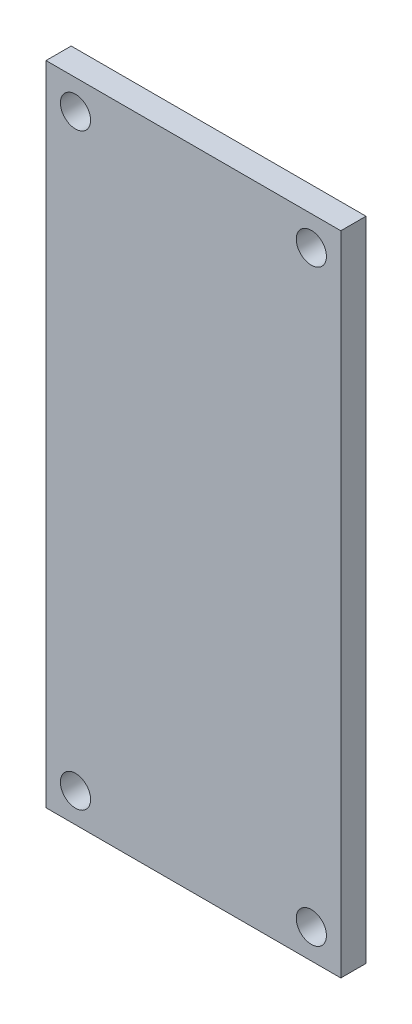
ISO-10303-21;
HEADER;
FILE_DESCRIPTION(('STEP AP214'),'2;1');
FILE_NAME('part.step','',(''),(''),'','','');
FILE_SCHEMA(('AUTOMOTIVE_DESIGN { 1 0 10303 214 1 1 1 1 }'));
ENDSEC;
DATA;
#1=APPLICATION_CONTEXT('core data for automotive mechanical design processes');
#2=APPLICATION_PROTOCOL_DEFINITION('international standard','automotive_design',2000,#1);
#3=PRODUCT_CONTEXT('',#1,'mechanical');
#4=PRODUCT('Part','Part','',(#3));
#5=PRODUCT_RELATED_PRODUCT_CATEGORY('part','',(#4));
#6=PRODUCT_DEFINITION_FORMATION('','',#4);
#7=PRODUCT_DEFINITION_CONTEXT('part definition',#1,'design');
#8=PRODUCT_DEFINITION('design','',#6,#7);
#9=PRODUCT_DEFINITION_SHAPE('','',#8);
#10=(LENGTH_UNIT() NAMED_UNIT(*) SI_UNIT(.MILLI.,.METRE.));
#11=(NAMED_UNIT(*) PLANE_ANGLE_UNIT() SI_UNIT($,.RADIAN.));
#12=(NAMED_UNIT(*) SI_UNIT($,.STERADIAN.) SOLID_ANGLE_UNIT());
#13=UNCERTAINTY_MEASURE_WITH_UNIT(LENGTH_MEASURE(1.E-05),#10,'distance_accuracy_value','');
#14=(GEOMETRIC_REPRESENTATION_CONTEXT(3) GLOBAL_UNCERTAINTY_ASSIGNED_CONTEXT((#13)) GLOBAL_UNIT_ASSIGNED_CONTEXT((#10,
#11,#12)) REPRESENTATION_CONTEXT('',''));
#15=CARTESIAN_POINT('',(0.,0.,0.));
#16=DIRECTION('',(0.,0.,1.));
#17=DIRECTION('',(1.,0.,0.));
#18=AXIS2_PLACEMENT_3D('',#15,#16,#17);
#19=CARTESIAN_POINT('',(-10.25,22.5,1.75));
#20=DIRECTION('',(1.,0.,0.));
#21=DIRECTION('',(0.,0.,-1.));
#22=AXIS2_PLACEMENT_3D('',#19,#20,#21);
#23=PLANE('',#22);
#24=DIRECTION('',(0.,-1.,0.));
#25=VECTOR('',#24,1.);
#26=CARTESIAN_POINT('',(-10.25,22.5,0.));
#27=LINE('',#26,#25);
#28=CARTESIAN_POINT('',(-10.25,22.5,0.));
#29=VERTEX_POINT('',#28);
#30=CARTESIAN_POINT('',(-10.25,-22.5,0.));
#31=VERTEX_POINT('',#30);
#32=EDGE_CURVE('E99',#29,#31,#27,.T.);
#33=ORIENTED_EDGE('',*,*,#32,.T.);
#34=DIRECTION('',(0.,0.,-1.));
#35=VECTOR('',#34,1.);
#36=CARTESIAN_POINT('',(-10.25,-22.5,1.75));
#37=LINE('',#36,#35);
#38=CARTESIAN_POINT('',(-10.25,-22.5,1.75));
#39=VERTEX_POINT('',#38);
#40=EDGE_CURVE('E11',#39,#31,#37,.T.);
#41=ORIENTED_EDGE('',*,*,#40,.F.);
#42=DIRECTION('',(0.,-1.,0.));
#43=VECTOR('',#42,1.);
#44=CARTESIAN_POINT('',(-10.25,22.5,1.75));
#45=LINE('',#44,#43);
#46=CARTESIAN_POINT('',(-10.25,22.5,1.75));
#47=VERTEX_POINT('',#46);
#48=EDGE_CURVE('E87',#47,#39,#45,.T.);
#49=ORIENTED_EDGE('',*,*,#48,.F.);
#50=DIRECTION('',(0.,0.,-1.));
#51=VECTOR('',#50,1.);
#52=CARTESIAN_POINT('',(-10.25,22.5,1.75));
#53=LINE('',#52,#51);
#54=EDGE_CURVE('E95',#47,#29,#53,.T.);
#55=ORIENTED_EDGE('',*,*,#54,.T.);
#56=EDGE_LOOP('',(#33,#41,#49,#55));
#57=FACE_BOUND('',#56,.T.);
#58=ADVANCED_FACE('F36',(#57),#23,.F.);
#59=CARTESIAN_POINT('',(-10.25,-22.5,1.75));
#60=DIRECTION('',(0.,1.,0.));
#61=DIRECTION('',(0.,0.,1.));
#62=AXIS2_PLACEMENT_3D('',#59,#60,#61);
#63=PLANE('',#62);
#64=DIRECTION('',(1.,0.,0.));
#65=VECTOR('',#64,1.);
#66=CARTESIAN_POINT('',(-10.25,-22.5,0.));
#67=LINE('',#66,#65);
#68=CARTESIAN_POINT('',(10.25,-22.5,0.));
#69=VERTEX_POINT('',#68);
#70=EDGE_CURVE('E91',#31,#69,#67,.T.);
#71=ORIENTED_EDGE('',*,*,#70,.T.);
#72=DIRECTION('',(0.,0.,-1.));
#73=VECTOR('',#72,1.);
#74=CARTESIAN_POINT('',(10.25,-22.5,1.75));
#75=LINE('',#74,#73);
#76=CARTESIAN_POINT('',(10.25,-22.5,1.75));
#77=VERTEX_POINT('',#76);
#78=EDGE_CURVE('E44',#77,#69,#75,.T.);
#79=ORIENTED_EDGE('',*,*,#78,.F.);
#80=DIRECTION('',(1.,0.,0.));
#81=VECTOR('',#80,1.);
#82=CARTESIAN_POINT('',(-10.25,-22.5,1.75));
#83=LINE('',#82,#81);
#84=EDGE_CURVE('E82',#39,#77,#83,.T.);
#85=ORIENTED_EDGE('',*,*,#84,.F.);
#86=ORIENTED_EDGE('',*,*,#40,.T.);
#87=EDGE_LOOP('',(#71,#79,#85,#86));
#88=FACE_BOUND('',#87,.T.);
#89=ADVANCED_FACE('F90',(#88),#63,.F.);
#90=CARTESIAN_POINT('',(10.25,22.5,1.75));
#91=DIRECTION('',(-1.,0.,0.));
#92=DIRECTION('',(0.,0.,1.));
#93=AXIS2_PLACEMENT_3D('',#90,#91,#92);
#94=PLANE('',#93);
#95=DIRECTION('',(0.,1.,0.));
#96=VECTOR('',#95,1.);
#97=CARTESIAN_POINT('',(10.25,22.5,0.));
#98=LINE('',#97,#96);
#99=CARTESIAN_POINT('',(10.25,22.5,0.));
#100=VERTEX_POINT('',#99);
#101=EDGE_CURVE('E69',#69,#100,#98,.T.);
#102=ORIENTED_EDGE('',*,*,#101,.T.);
#103=DIRECTION('',(0.,0.,-1.));
#104=VECTOR('',#103,1.);
#105=CARTESIAN_POINT('',(10.25,22.5,1.75));
#106=LINE('',#105,#104);
#107=CARTESIAN_POINT('',(10.25,22.5,1.75));
#108=VERTEX_POINT('',#107);
#109=EDGE_CURVE('E92',#108,#100,#106,.T.);
#110=ORIENTED_EDGE('',*,*,#109,.F.);
#111=DIRECTION('',(0.,1.,0.));
#112=VECTOR('',#111,1.);
#113=CARTESIAN_POINT('',(10.25,22.5,1.75));
#114=LINE('',#113,#112);
#115=EDGE_CURVE('E85',#77,#108,#114,.T.);
#116=ORIENTED_EDGE('',*,*,#115,.F.);
#117=ORIENTED_EDGE('',*,*,#78,.T.);
#118=EDGE_LOOP('',(#102,#110,#116,#117));
#119=FACE_BOUND('',#118,.T.);
#120=ADVANCED_FACE('F93',(#119),#94,.F.);
#121=CARTESIAN_POINT('',(-10.25,22.5,1.75));
#122=DIRECTION('',(0.,-1.,0.));
#123=DIRECTION('',(0.,0.,-1.));
#124=AXIS2_PLACEMENT_3D('',#121,#122,#123);
#125=PLANE('',#124);
#126=DIRECTION('',(-1.,0.,0.));
#127=VECTOR('',#126,1.);
#128=CARTESIAN_POINT('',(-10.25,22.5,0.));
#129=LINE('',#128,#127);
#130=EDGE_CURVE('E75',#100,#29,#129,.T.);
#131=ORIENTED_EDGE('',*,*,#130,.T.);
#132=ORIENTED_EDGE('',*,*,#54,.F.);
#133=DIRECTION('',(-1.,0.,0.));
#134=VECTOR('',#133,1.);
#135=CARTESIAN_POINT('',(-10.25,22.5,1.75));
#136=LINE('',#135,#134);
#137=EDGE_CURVE('E52',#108,#47,#136,.T.);
#138=ORIENTED_EDGE('',*,*,#137,.F.);
#139=ORIENTED_EDGE('',*,*,#109,.T.);
#140=EDGE_LOOP('',(#131,#132,#138,#139));
#141=FACE_BOUND('',#140,.T.);
#142=ADVANCED_FACE('F107',(#141),#125,.F.);
#143=CARTESIAN_POINT('',(-10.25,-22.5,1.75));
#144=DIRECTION('',(0.,0.,1.));
#145=DIRECTION('',(1.,0.,0.));
#146=AXIS2_PLACEMENT_3D('',#143,#144,#145);
#147=PLANE('',#146);
#148=CARTESIAN_POINT('',(8.2,20.45,1.75));
#149=DIRECTION('',(0.,0.,1.));
#150=DIRECTION('',(1.,0.,0.));
#151=AXIS2_PLACEMENT_3D('',#148,#149,#150);
#152=CIRCLE('',#151,1.05);
#153=CARTESIAN_POINT('',(9.25,20.45,1.75));
#154=VERTEX_POINT('',#153);
#155=EDGE_CURVE('E133',#154,#154,#152,.T.);
#156=ORIENTED_EDGE('',*,*,#155,.F.);
#157=EDGE_LOOP('',(#156));
#158=FACE_BOUND('',#157,.T.);
#159=CARTESIAN_POINT('',(-8.2,-20.45,1.75));
#160=DIRECTION('',(0.,0.,1.));
#161=DIRECTION('',(1.,0.,0.));
#162=AXIS2_PLACEMENT_3D('',#159,#160,#161);
#163=CIRCLE('',#162,1.05);
#164=CARTESIAN_POINT('',(-7.15,-20.45,1.75));
#165=VERTEX_POINT('',#164);
#166=EDGE_CURVE('E127',#165,#165,#163,.T.);
#167=ORIENTED_EDGE('',*,*,#166,.F.);
#168=EDGE_LOOP('',(#167));
#169=FACE_BOUND('',#168,.T.);
#170=CARTESIAN_POINT('',(-8.2,20.45,1.75));
#171=DIRECTION('',(0.,0.,1.));
#172=DIRECTION('',(1.,0.,0.));
#173=AXIS2_PLACEMENT_3D('',#170,#171,#172);
#174=CIRCLE('',#173,1.05);
#175=CARTESIAN_POINT('',(-7.15,20.45,1.75));
#176=VERTEX_POINT('',#175);
#177=EDGE_CURVE('E121',#176,#176,#174,.T.);
#178=ORIENTED_EDGE('',*,*,#177,.F.);
#179=EDGE_LOOP('',(#178));
#180=FACE_BOUND('',#179,.T.);
#181=CARTESIAN_POINT('',(8.2,-20.45,1.75));
#182=DIRECTION('',(0.,0.,1.));
#183=DIRECTION('',(1.,0.,0.));
#184=AXIS2_PLACEMENT_3D('',#181,#182,#183);
#185=CIRCLE('',#184,1.05);
#186=CARTESIAN_POINT('',(9.25,-20.45,1.75));
#187=VERTEX_POINT('',#186);
#188=EDGE_CURVE('E115',#187,#187,#185,.T.);
#189=ORIENTED_EDGE('',*,*,#188,.F.);
#190=EDGE_LOOP('',(#189));
#191=FACE_BOUND('',#190,.T.);
#192=ORIENTED_EDGE('',*,*,#48,.T.);
#193=ORIENTED_EDGE('',*,*,#84,.T.);
#194=ORIENTED_EDGE('',*,*,#115,.T.);
#195=ORIENTED_EDGE('',*,*,#137,.T.);
#196=EDGE_LOOP('',(#192,#193,#194,#195));
#197=FACE_BOUND('',#196,.T.);
#198=ADVANCED_FACE('F83',(#158,#169,#180,#191,#197),#147,.T.);
#199=CARTESIAN_POINT('',(-10.25,-22.5,0.));
#200=DIRECTION('',(0.,0.,1.));
#201=DIRECTION('',(1.,0.,0.));
#202=AXIS2_PLACEMENT_3D('',#199,#200,#201);
#203=PLANE('',#202);
#204=CARTESIAN_POINT('',(8.2,20.45,0.));
#205=DIRECTION('',(0.,0.,1.));
#206=DIRECTION('',(1.,0.,0.));
#207=AXIS2_PLACEMENT_3D('',#204,#205,#206);
#208=CIRCLE('',#207,1.05);
#209=CARTESIAN_POINT('',(9.25,20.45,0.));
#210=VERTEX_POINT('',#209);
#211=EDGE_CURVE('E130',#210,#210,#208,.F.);
#212=ORIENTED_EDGE('',*,*,#211,.F.);
#213=EDGE_LOOP('',(#212));
#214=FACE_BOUND('',#213,.T.);
#215=CARTESIAN_POINT('',(-8.2,-20.45,0.));
#216=DIRECTION('',(0.,0.,1.));
#217=DIRECTION('',(1.,0.,0.));
#218=AXIS2_PLACEMENT_3D('',#215,#216,#217);
#219=CIRCLE('',#218,1.05);
#220=CARTESIAN_POINT('',(-7.15,-20.45,0.));
#221=VERTEX_POINT('',#220);
#222=EDGE_CURVE('E124',#221,#221,#219,.F.);
#223=ORIENTED_EDGE('',*,*,#222,.F.);
#224=EDGE_LOOP('',(#223));
#225=FACE_BOUND('',#224,.T.);
#226=CARTESIAN_POINT('',(-8.2,20.45,0.));
#227=DIRECTION('',(0.,0.,1.));
#228=DIRECTION('',(1.,0.,0.));
#229=AXIS2_PLACEMENT_3D('',#226,#227,#228);
#230=CIRCLE('',#229,1.05);
#231=CARTESIAN_POINT('',(-7.15,20.45,0.));
#232=VERTEX_POINT('',#231);
#233=EDGE_CURVE('E118',#232,#232,#230,.F.);
#234=ORIENTED_EDGE('',*,*,#233,.F.);
#235=EDGE_LOOP('',(#234));
#236=FACE_BOUND('',#235,.T.);
#237=CARTESIAN_POINT('',(8.2,-20.45,0.));
#238=DIRECTION('',(0.,0.,1.));
#239=DIRECTION('',(1.,0.,0.));
#240=AXIS2_PLACEMENT_3D('',#237,#238,#239);
#241=CIRCLE('',#240,1.05);
#242=CARTESIAN_POINT('',(9.25,-20.45,0.));
#243=VERTEX_POINT('',#242);
#244=EDGE_CURVE('E102',#243,#243,#241,.F.);
#245=ORIENTED_EDGE('',*,*,#244,.F.);
#246=EDGE_LOOP('',(#245));
#247=FACE_BOUND('',#246,.T.);
#248=ORIENTED_EDGE('',*,*,#32,.F.);
#249=ORIENTED_EDGE('',*,*,#130,.F.);
#250=ORIENTED_EDGE('',*,*,#101,.F.);
#251=ORIENTED_EDGE('',*,*,#70,.F.);
#252=EDGE_LOOP('',(#248,#249,#250,#251));
#253=FACE_BOUND('',#252,.T.);
#254=ADVANCED_FACE('F110',(#214,#225,#236,#247,#253),#203,.F.);
#255=CARTESIAN_POINT('',(8.2,-20.45,-2.9698484809835));
#256=DIRECTION('',(0.,0.,1.));
#257=DIRECTION('',(1.,0.,0.));
#258=AXIS2_PLACEMENT_3D('',#255,#256,#257);
#259=CYLINDRICAL_SURFACE('',#258,1.05);
#260=ORIENTED_EDGE('',*,*,#244,.T.);
#261=EDGE_LOOP('',(#260));
#262=FACE_BOUND('',#261,.T.);
#263=ORIENTED_EDGE('',*,*,#188,.T.);
#264=EDGE_LOOP('',(#263));
#265=FACE_BOUND('',#264,.T.);
#266=ADVANCED_FACE('F148',(#262,#265),#259,.F.);
#267=CARTESIAN_POINT('',(-8.2,20.45,-2.9698484809835));
#268=DIRECTION('',(0.,0.,1.));
#269=DIRECTION('',(1.,0.,0.));
#270=AXIS2_PLACEMENT_3D('',#267,#268,#269);
#271=CYLINDRICAL_SURFACE('',#270,1.05);
#272=ORIENTED_EDGE('',*,*,#233,.T.);
#273=EDGE_LOOP('',(#272));
#274=FACE_BOUND('',#273,.T.);
#275=ORIENTED_EDGE('',*,*,#177,.T.);
#276=EDGE_LOOP('',(#275));
#277=FACE_BOUND('',#276,.T.);
#278=ADVANCED_FACE('F150',(#274,#277),#271,.F.);
#279=CARTESIAN_POINT('',(-8.2,-20.45,-2.9698484809835));
#280=DIRECTION('',(0.,0.,1.));
#281=DIRECTION('',(1.,0.,0.));
#282=AXIS2_PLACEMENT_3D('',#279,#280,#281);
#283=CYLINDRICAL_SURFACE('',#282,1.05);
#284=ORIENTED_EDGE('',*,*,#222,.T.);
#285=EDGE_LOOP('',(#284));
#286=FACE_BOUND('',#285,.T.);
#287=ORIENTED_EDGE('',*,*,#166,.T.);
#288=EDGE_LOOP('',(#287));
#289=FACE_BOUND('',#288,.T.);
#290=ADVANCED_FACE('F157',(#286,#289),#283,.F.);
#291=CARTESIAN_POINT('',(8.2,20.45,-2.9698484809835));
#292=DIRECTION('',(0.,0.,1.));
#293=DIRECTION('',(1.,0.,0.));
#294=AXIS2_PLACEMENT_3D('',#291,#292,#293);
#295=CYLINDRICAL_SURFACE('',#294,1.05);
#296=ORIENTED_EDGE('',*,*,#211,.T.);
#297=EDGE_LOOP('',(#296));
#298=FACE_BOUND('',#297,.T.);
#299=ORIENTED_EDGE('',*,*,#155,.T.);
#300=EDGE_LOOP('',(#299));
#301=FACE_BOUND('',#300,.T.);
#302=ADVANCED_FACE('F137',(#298,#301),#295,.F.);
#303=CLOSED_SHELL('',(#58,#89,#120,#142,#198,#254,#266,#278,#290,#302));
#304=MANIFOLD_SOLID_BREP('B2',#303);
#305=ADVANCED_BREP_SHAPE_REPRESENTATION('',(#18,#304),#14);
#306=SHAPE_DEFINITION_REPRESENTATION(#9,#305);
ENDSEC;
END-ISO-10303-21;
